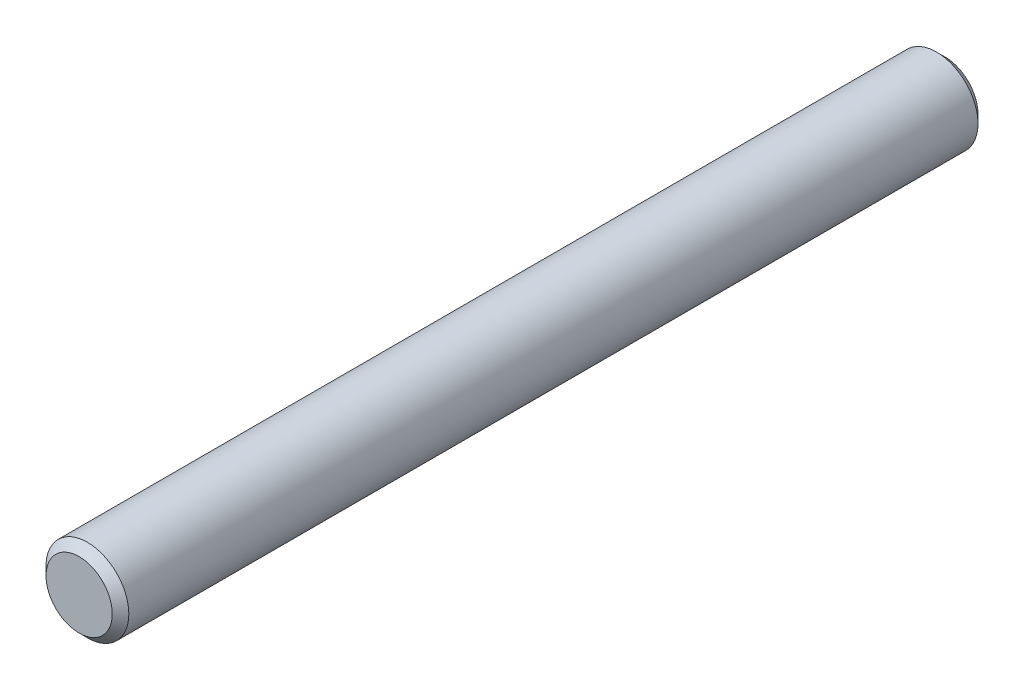
ISO-10303-21;
HEADER;
FILE_DESCRIPTION(('STEP AP214'),'2;1');
FILE_NAME('part.step','',(''),(''),'','','');
FILE_SCHEMA(('AUTOMOTIVE_DESIGN { 1 0 10303 214 1 1 1 1 }'));
ENDSEC;
DATA;
#1=APPLICATION_CONTEXT('core data for automotive mechanical design processes');
#2=APPLICATION_PROTOCOL_DEFINITION('international standard','automotive_design',2000,#1);
#3=PRODUCT_CONTEXT('',#1,'mechanical');
#4=PRODUCT('Part','Part','',(#3));
#5=PRODUCT_RELATED_PRODUCT_CATEGORY('part','',(#4));
#6=PRODUCT_DEFINITION_FORMATION('','',#4);
#7=PRODUCT_DEFINITION_CONTEXT('part definition',#1,'design');
#8=PRODUCT_DEFINITION('design','',#6,#7);
#9=PRODUCT_DEFINITION_SHAPE('','',#8);
#10=(LENGTH_UNIT() NAMED_UNIT(*) SI_UNIT(.MILLI.,.METRE.));
#11=(NAMED_UNIT(*) PLANE_ANGLE_UNIT() SI_UNIT($,.RADIAN.));
#12=(NAMED_UNIT(*) SI_UNIT($,.STERADIAN.) SOLID_ANGLE_UNIT());
#13=UNCERTAINTY_MEASURE_WITH_UNIT(LENGTH_MEASURE(1.E-05),#10,'distance_accuracy_value','');
#14=(GEOMETRIC_REPRESENTATION_CONTEXT(3) GLOBAL_UNCERTAINTY_ASSIGNED_CONTEXT((#13)) GLOBAL_UNIT_ASSIGNED_CONTEXT((#10,
#11,#12)) REPRESENTATION_CONTEXT('',''));
#15=CARTESIAN_POINT('',(0.,0.,0.));
#16=DIRECTION('',(0.,0.,1.));
#17=DIRECTION('',(1.,0.,0.));
#18=AXIS2_PLACEMENT_3D('',#15,#16,#17);
#19=CARTESIAN_POINT('',(0.,0.,49.784));
#20=DIRECTION('',(0.,0.,-1.));
#21=DIRECTION('',(-1.,0.,0.));
#22=AXIS2_PLACEMENT_3D('',#19,#20,#21);
#23=CYLINDRICAL_SURFACE('',#22,4.7625);
#24=CARTESIAN_POINT('',(0.,0.,-48.8315));
#25=DIRECTION('',(0.,0.,1.));
#26=DIRECTION('',(1.,0.,0.));
#27=AXIS2_PLACEMENT_3D('',#24,#25,#26);
#28=CIRCLE('',#27,4.7625);
#29=CARTESIAN_POINT('',(4.7625,0.,-48.8315));
#30=VERTEX_POINT('',#29);
#31=EDGE_CURVE('E43',#30,#30,#28,.T.);
#32=ORIENTED_EDGE('',*,*,#31,.T.);
#33=EDGE_LOOP('',(#32));
#34=FACE_BOUND('',#33,.T.);
#35=CARTESIAN_POINT('',(0.,0.,48.8315));
#36=DIRECTION('',(0.,0.,1.));
#37=DIRECTION('',(1.,0.,0.));
#38=AXIS2_PLACEMENT_3D('',#35,#36,#37);
#39=CIRCLE('',#38,4.7625);
#40=CARTESIAN_POINT('',(4.7625,0.,48.8315));
#41=VERTEX_POINT('',#40);
#42=EDGE_CURVE('E47',#41,#41,#39,.F.);
#43=ORIENTED_EDGE('',*,*,#42,.T.);
#44=EDGE_LOOP('',(#43));
#45=FACE_BOUND('',#44,.T.);
#46=ADVANCED_FACE('F32',(#34,#45),#23,.T.);
#47=CARTESIAN_POINT('',(0.,0.,49.784));
#48=DIRECTION('',(0.,0.,1.));
#49=DIRECTION('',(1.,0.,0.));
#50=AXIS2_PLACEMENT_3D('',#47,#48,#49);
#51=PLANE('',#50);
#52=CARTESIAN_POINT('',(0.,0.,49.784));
#53=DIRECTION('',(0.,0.,1.));
#54=DIRECTION('',(1.,0.,0.));
#55=AXIS2_PLACEMENT_3D('',#52,#53,#54);
#56=CIRCLE('',#55,3.80999999999997);
#57=CARTESIAN_POINT('',(3.80999999999997,0.,49.784));
#58=VERTEX_POINT('',#57);
#59=EDGE_CURVE('E10',#58,#58,#56,.T.);
#60=ORIENTED_EDGE('',*,*,#59,.T.);
#61=EDGE_LOOP('',(#60));
#62=FACE_BOUND('',#61,.T.);
#63=ADVANCED_FACE('F63',(#62),#51,.T.);
#64=CARTESIAN_POINT('',(0.,0.,-49.784));
#65=DIRECTION('',(0.,0.,1.));
#66=DIRECTION('',(1.,0.,0.));
#67=AXIS2_PLACEMENT_3D('',#64,#65,#66);
#68=PLANE('',#67);
#69=CARTESIAN_POINT('',(0.,0.,-49.784));
#70=DIRECTION('',(0.,0.,1.));
#71=DIRECTION('',(1.,0.,0.));
#72=AXIS2_PLACEMENT_3D('',#69,#70,#71);
#73=CIRCLE('',#72,3.80999999999999);
#74=CARTESIAN_POINT('',(3.80999999999999,0.,-49.784));
#75=VERTEX_POINT('',#74);
#76=EDGE_CURVE('E39',#75,#75,#73,.F.);
#77=ORIENTED_EDGE('',*,*,#76,.T.);
#78=EDGE_LOOP('',(#77));
#79=FACE_BOUND('',#78,.T.);
#80=ADVANCED_FACE('F60',(#79),#68,.F.);
#81=CARTESIAN_POINT('',(0.,0.,-48.8315));
#82=DIRECTION('',(0.,0.,1.));
#83=DIRECTION('',(1.,0.,0.));
#84=AXIS2_PLACEMENT_3D('',#81,#82,#83);
#85=CONICAL_SURFACE('',#84,4.7625,0.785398163397447);
#86=ORIENTED_EDGE('',*,*,#76,.F.);
#87=EDGE_LOOP('',(#86));
#88=FACE_BOUND('',#87,.T.);
#89=ORIENTED_EDGE('',*,*,#31,.F.);
#90=EDGE_LOOP('',(#89));
#91=FACE_BOUND('',#90,.T.);
#92=ADVANCED_FACE('F56',(#88,#91),#85,.T.);
#93=CARTESIAN_POINT('',(0.,0.,49.784));
#94=DIRECTION('',(0.,0.,-1.));
#95=DIRECTION('',(-1.,0.,0.));
#96=AXIS2_PLACEMENT_3D('',#93,#94,#95);
#97=CONICAL_SURFACE('',#96,3.80999999999997,0.785398163397454);
#98=ORIENTED_EDGE('',*,*,#42,.F.);
#99=EDGE_LOOP('',(#98));
#100=FACE_BOUND('',#99,.T.);
#101=ORIENTED_EDGE('',*,*,#59,.F.);
#102=EDGE_LOOP('',(#101));
#103=FACE_BOUND('',#102,.T.);
#104=ADVANCED_FACE('F34',(#100,#103),#97,.T.);
#105=CLOSED_SHELL('',(#46,#63,#80,#92,#104));
#106=MANIFOLD_SOLID_BREP('B2',#105);
#107=ADVANCED_BREP_SHAPE_REPRESENTATION('',(#18,#106),#14);
#108=SHAPE_DEFINITION_REPRESENTATION(#9,#107);
ENDSEC;
END-ISO-10303-21;
